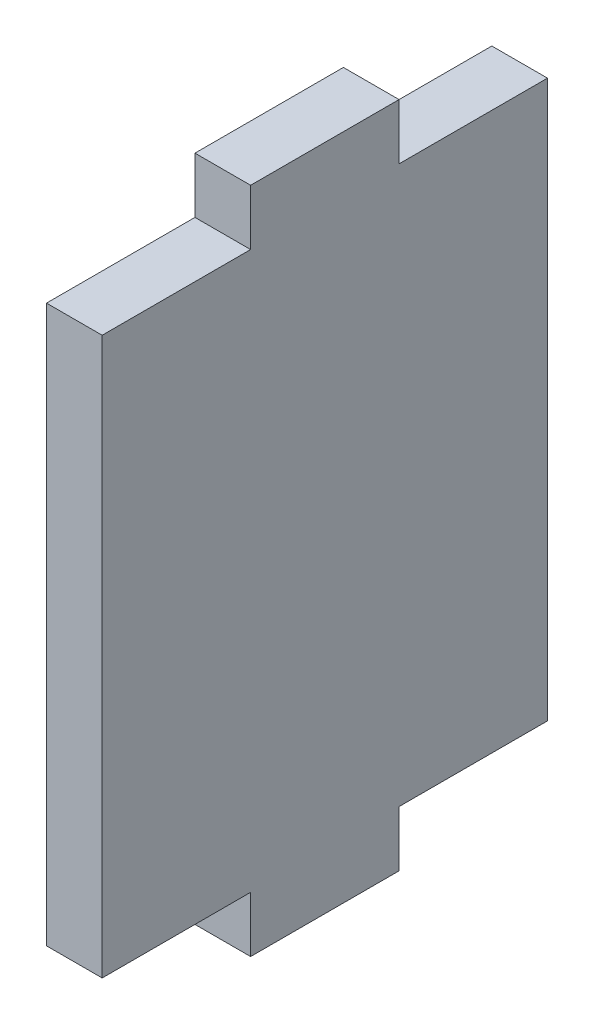
ISO-10303-21;
HEADER;
FILE_DESCRIPTION(('STEP AP214'),'2;1');
FILE_NAME('part.step','',(''),(''),'','','');
FILE_SCHEMA(('AUTOMOTIVE_DESIGN { 1 0 10303 214 1 1 1 1 }'));
ENDSEC;
DATA;
#1=APPLICATION_CONTEXT('core data for automotive mechanical design processes');
#2=APPLICATION_PROTOCOL_DEFINITION('international standard','automotive_design',2000,#1);
#3=PRODUCT_CONTEXT('',#1,'mechanical');
#4=PRODUCT('Part','Part','',(#3));
#5=PRODUCT_RELATED_PRODUCT_CATEGORY('part','',(#4));
#6=PRODUCT_DEFINITION_FORMATION('','',#4);
#7=PRODUCT_DEFINITION_CONTEXT('part definition',#1,'design');
#8=PRODUCT_DEFINITION('design','',#6,#7);
#9=PRODUCT_DEFINITION_SHAPE('','',#8);
#10=(LENGTH_UNIT() NAMED_UNIT(*) SI_UNIT(.MILLI.,.METRE.));
#11=(NAMED_UNIT(*) PLANE_ANGLE_UNIT() SI_UNIT($,.RADIAN.));
#12=(NAMED_UNIT(*) SI_UNIT($,.STERADIAN.) SOLID_ANGLE_UNIT());
#13=UNCERTAINTY_MEASURE_WITH_UNIT(LENGTH_MEASURE(1.E-05),#10,'distance_accuracy_value','');
#14=(GEOMETRIC_REPRESENTATION_CONTEXT(3) GLOBAL_UNCERTAINTY_ASSIGNED_CONTEXT((#13)) GLOBAL_UNIT_ASSIGNED_CONTEXT((#10,
#11,#12)) REPRESENTATION_CONTEXT('',''));
#15=CARTESIAN_POINT('',(0.,0.,0.));
#16=DIRECTION('',(0.,0.,1.));
#17=DIRECTION('',(1.,0.,0.));
#18=AXIS2_PLACEMENT_3D('',#15,#16,#17);
#19=CARTESIAN_POINT('',(3.,0.,4.));
#20=DIRECTION('',(0.,0.,-1.));
#21=DIRECTION('',(-1.,0.,0.));
#22=AXIS2_PLACEMENT_3D('',#19,#20,#21);
#23=PLANE('',#22);
#24=DIRECTION('',(0.,-1.,0.));
#25=VECTOR('',#24,1.);
#26=CARTESIAN_POINT('',(0.,0.,4.));
#27=LINE('',#26,#25);
#28=CARTESIAN_POINT('',(0.,18.,4.));
#29=VERTEX_POINT('',#28);
#30=CARTESIAN_POINT('',(0.,15.,4.));
#31=VERTEX_POINT('',#30);
#32=EDGE_CURVE('E156',#29,#31,#27,.T.);
#33=ORIENTED_EDGE('',*,*,#32,.T.);
#34=DIRECTION('',(-1.,0.,0.));
#35=VECTOR('',#34,1.);
#36=CARTESIAN_POINT('',(3.,15.,4.));
#37=LINE('',#36,#35);
#38=CARTESIAN_POINT('',(3.,15.,4.));
#39=VERTEX_POINT('',#38);
#40=EDGE_CURVE('E11',#39,#31,#37,.T.);
#41=ORIENTED_EDGE('',*,*,#40,.F.);
#42=DIRECTION('',(0.,-1.,0.));
#43=VECTOR('',#42,1.);
#44=CARTESIAN_POINT('',(3.,0.,4.));
#45=LINE('',#44,#43);
#46=CARTESIAN_POINT('',(3.,18.,4.));
#47=VERTEX_POINT('',#46);
#48=EDGE_CURVE('E185',#47,#39,#45,.T.);
#49=ORIENTED_EDGE('',*,*,#48,.F.);
#50=DIRECTION('',(-1.,0.,0.));
#51=VECTOR('',#50,1.);
#52=CARTESIAN_POINT('',(3.,18.,4.));
#53=LINE('',#52,#51);
#54=EDGE_CURVE('E155',#47,#29,#53,.T.);
#55=ORIENTED_EDGE('',*,*,#54,.T.);
#56=EDGE_LOOP('',(#33,#41,#49,#55));
#57=FACE_BOUND('',#56,.T.);
#58=ADVANCED_FACE('F35',(#57),#23,.F.);
#59=CARTESIAN_POINT('',(3.,15.,0.));
#60=DIRECTION('',(0.,-1.,0.));
#61=DIRECTION('',(0.,0.,-1.));
#62=AXIS2_PLACEMENT_3D('',#59,#60,#61);
#63=PLANE('',#62);
#64=DIRECTION('',(0.,0.,1.));
#65=VECTOR('',#64,1.);
#66=CARTESIAN_POINT('',(0.,15.,0.));
#67=LINE('',#66,#65);
#68=CARTESIAN_POINT('',(0.,15.,12.));
#69=VERTEX_POINT('',#68);
#70=EDGE_CURVE('E159',#31,#69,#67,.T.);
#71=ORIENTED_EDGE('',*,*,#70,.T.);
#72=DIRECTION('',(-1.,0.,0.));
#73=VECTOR('',#72,1.);
#74=CARTESIAN_POINT('',(3.,15.,12.));
#75=LINE('',#74,#73);
#76=CARTESIAN_POINT('',(3.,15.,12.));
#77=VERTEX_POINT('',#76);
#78=EDGE_CURVE('E43',#77,#69,#75,.T.);
#79=ORIENTED_EDGE('',*,*,#78,.F.);
#80=DIRECTION('',(0.,0.,1.));
#81=VECTOR('',#80,1.);
#82=CARTESIAN_POINT('',(3.,15.,0.));
#83=LINE('',#82,#81);
#84=EDGE_CURVE('E105',#39,#77,#83,.T.);
#85=ORIENTED_EDGE('',*,*,#84,.F.);
#86=ORIENTED_EDGE('',*,*,#40,.T.);
#87=EDGE_LOOP('',(#71,#79,#85,#86));
#88=FACE_BOUND('',#87,.T.);
#89=ADVANCED_FACE('F207',(#88),#63,.F.);
#90=CARTESIAN_POINT('',(3.,0.,12.));
#91=DIRECTION('',(0.,0.,1.));
#92=DIRECTION('',(1.,0.,0.));
#93=AXIS2_PLACEMENT_3D('',#90,#91,#92);
#94=PLANE('',#93);
#95=DIRECTION('',(0.,1.,0.));
#96=VECTOR('',#95,1.);
#97=CARTESIAN_POINT('',(0.,0.,12.));
#98=LINE('',#97,#96);
#99=CARTESIAN_POINT('',(0.,-15.,12.));
#100=VERTEX_POINT('',#99);
#101=EDGE_CURVE('E162',#100,#69,#98,.T.);
#102=ORIENTED_EDGE('',*,*,#101,.F.);
#103=DIRECTION('',(-1.,0.,0.));
#104=VECTOR('',#103,1.);
#105=CARTESIAN_POINT('',(3.,-15.,12.));
#106=LINE('',#105,#104);
#107=CARTESIAN_POINT('',(3.,-15.,12.));
#108=VERTEX_POINT('',#107);
#109=EDGE_CURVE('E200',#108,#100,#106,.T.);
#110=ORIENTED_EDGE('',*,*,#109,.F.);
#111=DIRECTION('',(0.,1.,0.));
#112=VECTOR('',#111,1.);
#113=CARTESIAN_POINT('',(3.,0.,12.));
#114=LINE('',#113,#112);
#115=EDGE_CURVE('E206',#108,#77,#114,.T.);
#116=ORIENTED_EDGE('',*,*,#115,.T.);
#117=ORIENTED_EDGE('',*,*,#78,.T.);
#118=EDGE_LOOP('',(#102,#110,#116,#117));
#119=FACE_BOUND('',#118,.T.);
#120=ADVANCED_FACE('F204',(#119),#94,.T.);
#121=CARTESIAN_POINT('',(3.,-15.,0.));
#122=DIRECTION('',(0.,-1.,0.));
#123=DIRECTION('',(0.,0.,-1.));
#124=AXIS2_PLACEMENT_3D('',#121,#122,#123);
#125=PLANE('',#124);
#126=DIRECTION('',(0.,0.,1.));
#127=VECTOR('',#126,1.);
#128=CARTESIAN_POINT('',(0.,-15.,0.));
#129=LINE('',#128,#127);
#130=CARTESIAN_POINT('',(0.,-15.,4.));
#131=VERTEX_POINT('',#130);
#132=EDGE_CURVE('E165',#131,#100,#129,.T.);
#133=ORIENTED_EDGE('',*,*,#132,.F.);
#134=DIRECTION('',(-1.,0.,0.));
#135=VECTOR('',#134,1.);
#136=CARTESIAN_POINT('',(3.,-15.,4.));
#137=LINE('',#136,#135);
#138=CARTESIAN_POINT('',(3.,-15.,4.));
#139=VERTEX_POINT('',#138);
#140=EDGE_CURVE('E198',#139,#131,#137,.T.);
#141=ORIENTED_EDGE('',*,*,#140,.F.);
#142=DIRECTION('',(0.,0.,1.));
#143=VECTOR('',#142,1.);
#144=CARTESIAN_POINT('',(3.,-15.,0.));
#145=LINE('',#144,#143);
#146=EDGE_CURVE('E218',#139,#108,#145,.T.);
#147=ORIENTED_EDGE('',*,*,#146,.T.);
#148=ORIENTED_EDGE('',*,*,#109,.T.);
#149=EDGE_LOOP('',(#133,#141,#147,#148));
#150=FACE_BOUND('',#149,.T.);
#151=ADVANCED_FACE('F215',(#150),#125,.T.);
#152=CARTESIAN_POINT('',(3.,0.,4.));
#153=DIRECTION('',(0.,0.,1.));
#154=DIRECTION('',(1.,0.,0.));
#155=AXIS2_PLACEMENT_3D('',#152,#153,#154);
#156=PLANE('',#155);
#157=DIRECTION('',(0.,1.,0.));
#158=VECTOR('',#157,1.);
#159=CARTESIAN_POINT('',(0.,0.,4.));
#160=LINE('',#159,#158);
#161=CARTESIAN_POINT('',(0.,-18.,4.));
#162=VERTEX_POINT('',#161);
#163=EDGE_CURVE('E168',#162,#131,#160,.T.);
#164=ORIENTED_EDGE('',*,*,#163,.F.);
#165=DIRECTION('',(-1.,0.,0.));
#166=VECTOR('',#165,1.);
#167=CARTESIAN_POINT('',(3.,-18.,4.));
#168=LINE('',#167,#166);
#169=CARTESIAN_POINT('',(3.,-18.,4.));
#170=VERTEX_POINT('',#169);
#171=EDGE_CURVE('E196',#170,#162,#168,.T.);
#172=ORIENTED_EDGE('',*,*,#171,.F.);
#173=DIRECTION('',(0.,1.,0.));
#174=VECTOR('',#173,1.);
#175=CARTESIAN_POINT('',(3.,0.,4.));
#176=LINE('',#175,#174);
#177=EDGE_CURVE('E222',#170,#139,#176,.T.);
#178=ORIENTED_EDGE('',*,*,#177,.T.);
#179=ORIENTED_EDGE('',*,*,#140,.T.);
#180=EDGE_LOOP('',(#164,#172,#178,#179));
#181=FACE_BOUND('',#180,.T.);
#182=ADVANCED_FACE('F266',(#181),#156,.T.);
#183=CARTESIAN_POINT('',(3.,-18.,0.));
#184=DIRECTION('',(0.,-1.,0.));
#185=DIRECTION('',(0.,0.,-1.));
#186=AXIS2_PLACEMENT_3D('',#183,#184,#185);
#187=PLANE('',#186);
#188=DIRECTION('',(0.,0.,1.));
#189=VECTOR('',#188,1.);
#190=CARTESIAN_POINT('',(0.,-18.,0.));
#191=LINE('',#190,#189);
#192=CARTESIAN_POINT('',(0.,-18.,-4.));
#193=VERTEX_POINT('',#192);
#194=EDGE_CURVE('E171',#193,#162,#191,.T.);
#195=ORIENTED_EDGE('',*,*,#194,.F.);
#196=DIRECTION('',(-1.,0.,0.));
#197=VECTOR('',#196,1.);
#198=CARTESIAN_POINT('',(3.,-18.,-4.));
#199=LINE('',#198,#197);
#200=CARTESIAN_POINT('',(3.,-18.,-4.));
#201=VERTEX_POINT('',#200);
#202=EDGE_CURVE('E194',#201,#193,#199,.T.);
#203=ORIENTED_EDGE('',*,*,#202,.F.);
#204=DIRECTION('',(0.,0.,1.));
#205=VECTOR('',#204,1.);
#206=CARTESIAN_POINT('',(3.,-18.,0.));
#207=LINE('',#206,#205);
#208=EDGE_CURVE('E228',#201,#170,#207,.T.);
#209=ORIENTED_EDGE('',*,*,#208,.T.);
#210=ORIENTED_EDGE('',*,*,#171,.T.);
#211=EDGE_LOOP('',(#195,#203,#209,#210));
#212=FACE_BOUND('',#211,.T.);
#213=ADVANCED_FACE('F269',(#212),#187,.T.);
#214=CARTESIAN_POINT('',(3.,0.,-4.));
#215=DIRECTION('',(0.,0.,-1.));
#216=DIRECTION('',(-1.,0.,0.));
#217=AXIS2_PLACEMENT_3D('',#214,#215,#216);
#218=PLANE('',#217);
#219=DIRECTION('',(0.,-1.,0.));
#220=VECTOR('',#219,1.);
#221=CARTESIAN_POINT('',(0.,0.,-4.));
#222=LINE('',#221,#220);
#223=CARTESIAN_POINT('',(0.,-15.,-4.));
#224=VERTEX_POINT('',#223);
#225=EDGE_CURVE('E174',#224,#193,#222,.T.);
#226=ORIENTED_EDGE('',*,*,#225,.F.);
#227=DIRECTION('',(-1.,0.,0.));
#228=VECTOR('',#227,1.);
#229=CARTESIAN_POINT('',(3.,-15.,-4.));
#230=LINE('',#229,#228);
#231=CARTESIAN_POINT('',(3.,-15.,-4.));
#232=VERTEX_POINT('',#231);
#233=EDGE_CURVE('E192',#232,#224,#230,.T.);
#234=ORIENTED_EDGE('',*,*,#233,.F.);
#235=DIRECTION('',(0.,-1.,0.));
#236=VECTOR('',#235,1.);
#237=CARTESIAN_POINT('',(3.,0.,-4.));
#238=LINE('',#237,#236);
#239=EDGE_CURVE('E231',#232,#201,#238,.T.);
#240=ORIENTED_EDGE('',*,*,#239,.T.);
#241=ORIENTED_EDGE('',*,*,#202,.T.);
#242=EDGE_LOOP('',(#226,#234,#240,#241));
#243=FACE_BOUND('',#242,.T.);
#244=ADVANCED_FACE('F273',(#243),#218,.T.);
#245=CARTESIAN_POINT('',(3.,-15.,0.));
#246=DIRECTION('',(0.,1.,0.));
#247=DIRECTION('',(0.,0.,1.));
#248=AXIS2_PLACEMENT_3D('',#245,#246,#247);
#249=PLANE('',#248);
#250=DIRECTION('',(0.,0.,-1.));
#251=VECTOR('',#250,1.);
#252=CARTESIAN_POINT('',(0.,-15.,0.));
#253=LINE('',#252,#251);
#254=CARTESIAN_POINT('',(0.,-15.,-12.));
#255=VERTEX_POINT('',#254);
#256=EDGE_CURVE('E177',#224,#255,#253,.T.);
#257=ORIENTED_EDGE('',*,*,#256,.T.);
#258=DIRECTION('',(-1.,0.,0.));
#259=VECTOR('',#258,1.);
#260=CARTESIAN_POINT('',(3.,-15.,-12.));
#261=LINE('',#260,#259);
#262=CARTESIAN_POINT('',(3.,-15.,-12.));
#263=VERTEX_POINT('',#262);
#264=EDGE_CURVE('E189',#263,#255,#261,.T.);
#265=ORIENTED_EDGE('',*,*,#264,.F.);
#266=DIRECTION('',(0.,0.,-1.));
#267=VECTOR('',#266,1.);
#268=CARTESIAN_POINT('',(3.,-15.,0.));
#269=LINE('',#268,#267);
#270=EDGE_CURVE('E150',#232,#263,#269,.T.);
#271=ORIENTED_EDGE('',*,*,#270,.F.);
#272=ORIENTED_EDGE('',*,*,#233,.T.);
#273=EDGE_LOOP('',(#257,#265,#271,#272));
#274=FACE_BOUND('',#273,.T.);
#275=ADVANCED_FACE('F238',(#274),#249,.F.);
#276=CARTESIAN_POINT('',(3.,0.,-12.));
#277=DIRECTION('',(0.,0.,1.));
#278=DIRECTION('',(1.,0.,0.));
#279=AXIS2_PLACEMENT_3D('',#276,#277,#278);
#280=PLANE('',#279);
#281=DIRECTION('',(0.,1.,0.));
#282=VECTOR('',#281,1.);
#283=CARTESIAN_POINT('',(0.,0.,-12.));
#284=LINE('',#283,#282);
#285=CARTESIAN_POINT('',(0.,15.,-12.));
#286=VERTEX_POINT('',#285);
#287=EDGE_CURVE('E179',#255,#286,#284,.T.);
#288=ORIENTED_EDGE('',*,*,#287,.T.);
#289=DIRECTION('',(-1.,0.,0.));
#290=VECTOR('',#289,1.);
#291=CARTESIAN_POINT('',(3.,15.,-12.));
#292=LINE('',#291,#290);
#293=CARTESIAN_POINT('',(3.,15.,-12.));
#294=VERTEX_POINT('',#293);
#295=EDGE_CURVE('E139',#294,#286,#292,.T.);
#296=ORIENTED_EDGE('',*,*,#295,.F.);
#297=DIRECTION('',(0.,1.,0.));
#298=VECTOR('',#297,1.);
#299=CARTESIAN_POINT('',(3.,0.,-12.));
#300=LINE('',#299,#298);
#301=EDGE_CURVE('E147',#263,#294,#300,.T.);
#302=ORIENTED_EDGE('',*,*,#301,.F.);
#303=ORIENTED_EDGE('',*,*,#264,.T.);
#304=EDGE_LOOP('',(#288,#296,#302,#303));
#305=FACE_BOUND('',#304,.T.);
#306=ADVANCED_FACE('F242',(#305),#280,.F.);
#307=CARTESIAN_POINT('',(3.,15.,0.));
#308=DIRECTION('',(0.,1.,0.));
#309=DIRECTION('',(0.,0.,1.));
#310=AXIS2_PLACEMENT_3D('',#307,#308,#309);
#311=PLANE('',#310);
#312=DIRECTION('',(0.,0.,-1.));
#313=VECTOR('',#312,1.);
#314=CARTESIAN_POINT('',(0.,15.,0.));
#315=LINE('',#314,#313);
#316=CARTESIAN_POINT('',(0.,15.,-4.));
#317=VERTEX_POINT('',#316);
#318=EDGE_CURVE('E138',#317,#286,#315,.T.);
#319=ORIENTED_EDGE('',*,*,#318,.F.);
#320=DIRECTION('',(-1.,0.,0.));
#321=VECTOR('',#320,1.);
#322=CARTESIAN_POINT('',(3.,15.,-4.));
#323=LINE('',#322,#321);
#324=CARTESIAN_POINT('',(3.,15.,-4.));
#325=VERTEX_POINT('',#324);
#326=EDGE_CURVE('E132',#325,#317,#323,.T.);
#327=ORIENTED_EDGE('',*,*,#326,.F.);
#328=DIRECTION('',(0.,0.,-1.));
#329=VECTOR('',#328,1.);
#330=CARTESIAN_POINT('',(3.,15.,0.));
#331=LINE('',#330,#329);
#332=EDGE_CURVE('E136',#325,#294,#331,.T.);
#333=ORIENTED_EDGE('',*,*,#332,.T.);
#334=ORIENTED_EDGE('',*,*,#295,.T.);
#335=EDGE_LOOP('',(#319,#327,#333,#334));
#336=FACE_BOUND('',#335,.T.);
#337=ADVANCED_FACE('F134',(#336),#311,.T.);
#338=CARTESIAN_POINT('',(3.,0.,-4.));
#339=DIRECTION('',(0.,0.,1.));
#340=DIRECTION('',(1.,0.,0.));
#341=AXIS2_PLACEMENT_3D('',#338,#339,#340);
#342=PLANE('',#341);
#343=DIRECTION('',(0.,1.,0.));
#344=VECTOR('',#343,1.);
#345=CARTESIAN_POINT('',(0.,0.,-4.));
#346=LINE('',#345,#344);
#347=CARTESIAN_POINT('',(0.,18.,-4.));
#348=VERTEX_POINT('',#347);
#349=EDGE_CURVE('E91',#317,#348,#346,.T.);
#350=ORIENTED_EDGE('',*,*,#349,.T.);
#351=DIRECTION('',(-1.,0.,0.));
#352=VECTOR('',#351,1.);
#353=CARTESIAN_POINT('',(3.,18.,-4.));
#354=LINE('',#353,#352);
#355=CARTESIAN_POINT('',(3.,18.,-4.));
#356=VERTEX_POINT('',#355);
#357=EDGE_CURVE('E140',#356,#348,#354,.T.);
#358=ORIENTED_EDGE('',*,*,#357,.F.);
#359=DIRECTION('',(0.,1.,0.));
#360=VECTOR('',#359,1.);
#361=CARTESIAN_POINT('',(3.,0.,-4.));
#362=LINE('',#361,#360);
#363=EDGE_CURVE('E142',#325,#356,#362,.T.);
#364=ORIENTED_EDGE('',*,*,#363,.F.);
#365=ORIENTED_EDGE('',*,*,#326,.T.);
#366=EDGE_LOOP('',(#350,#358,#364,#365));
#367=FACE_BOUND('',#366,.T.);
#368=ADVANCED_FACE('F143',(#367),#342,.F.);
#369=CARTESIAN_POINT('',(3.,18.,0.));
#370=DIRECTION('',(0.,-1.,0.));
#371=DIRECTION('',(0.,0.,-1.));
#372=AXIS2_PLACEMENT_3D('',#369,#370,#371);
#373=PLANE('',#372);
#374=DIRECTION('',(0.,0.,1.));
#375=VECTOR('',#374,1.);
#376=CARTESIAN_POINT('',(0.,18.,0.));
#377=LINE('',#376,#375);
#378=EDGE_CURVE('E97',#348,#29,#377,.T.);
#379=ORIENTED_EDGE('',*,*,#378,.T.);
#380=ORIENTED_EDGE('',*,*,#54,.F.);
#381=DIRECTION('',(0.,0.,1.));
#382=VECTOR('',#381,1.);
#383=CARTESIAN_POINT('',(3.,18.,0.));
#384=LINE('',#383,#382);
#385=EDGE_CURVE('E51',#356,#47,#384,.T.);
#386=ORIENTED_EDGE('',*,*,#385,.F.);
#387=ORIENTED_EDGE('',*,*,#357,.T.);
#388=EDGE_LOOP('',(#379,#380,#386,#387));
#389=FACE_BOUND('',#388,.T.);
#390=ADVANCED_FACE('F245',(#389),#373,.F.);
#391=CARTESIAN_POINT('',(3.,0.,0.));
#392=DIRECTION('',(1.,0.,0.));
#393=DIRECTION('',(0.,0.,-1.));
#394=AXIS2_PLACEMENT_3D('',#391,#392,#393);
#395=PLANE('',#394);
#396=ORIENTED_EDGE('',*,*,#48,.T.);
#397=ORIENTED_EDGE('',*,*,#84,.T.);
#398=ORIENTED_EDGE('',*,*,#115,.F.);
#399=ORIENTED_EDGE('',*,*,#146,.F.);
#400=ORIENTED_EDGE('',*,*,#177,.F.);
#401=ORIENTED_EDGE('',*,*,#208,.F.);
#402=ORIENTED_EDGE('',*,*,#239,.F.);
#403=ORIENTED_EDGE('',*,*,#270,.T.);
#404=ORIENTED_EDGE('',*,*,#301,.T.);
#405=ORIENTED_EDGE('',*,*,#332,.F.);
#406=ORIENTED_EDGE('',*,*,#363,.T.);
#407=ORIENTED_EDGE('',*,*,#385,.T.);
#408=EDGE_LOOP('',(#396,#397,#398,#399,#400,#401,#402,#403,#404,#405,#406,#407));
#409=FACE_BOUND('',#408,.T.);
#410=ADVANCED_FACE('F145',(#409),#395,.T.);
#411=CARTESIAN_POINT('',(0.,0.,0.));
#412=DIRECTION('',(1.,0.,0.));
#413=DIRECTION('',(0.,0.,-1.));
#414=AXIS2_PLACEMENT_3D('',#411,#412,#413);
#415=PLANE('',#414);
#416=ORIENTED_EDGE('',*,*,#32,.F.);
#417=ORIENTED_EDGE('',*,*,#378,.F.);
#418=ORIENTED_EDGE('',*,*,#349,.F.);
#419=ORIENTED_EDGE('',*,*,#318,.T.);
#420=ORIENTED_EDGE('',*,*,#287,.F.);
#421=ORIENTED_EDGE('',*,*,#256,.F.);
#422=ORIENTED_EDGE('',*,*,#225,.T.);
#423=ORIENTED_EDGE('',*,*,#194,.T.);
#424=ORIENTED_EDGE('',*,*,#163,.T.);
#425=ORIENTED_EDGE('',*,*,#132,.T.);
#426=ORIENTED_EDGE('',*,*,#101,.T.);
#427=ORIENTED_EDGE('',*,*,#70,.F.);
#428=EDGE_LOOP('',(#416,#417,#418,#419,#420,#421,#422,#423,#424,#425,#426,#427));
#429=FACE_BOUND('',#428,.T.);
#430=ADVANCED_FACE('F211',(#429),#415,.F.);
#431=CLOSED_SHELL('',(#58,#89,#120,#151,#182,#213,#244,#275,#306,#337,#368,#390,#410,#430));
#432=MANIFOLD_SOLID_BREP('B2',#431);
#433=ADVANCED_BREP_SHAPE_REPRESENTATION('',(#18,#432),#14);
#434=SHAPE_DEFINITION_REPRESENTATION(#9,#433);
ENDSEC;
END-ISO-10303-21;
